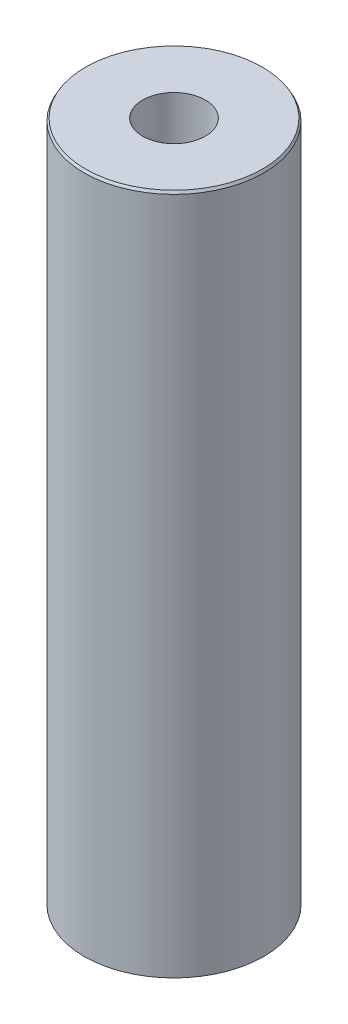
ISO-10303-21;
HEADER;
FILE_DESCRIPTION(('STEP AP214'),'2;1');
FILE_NAME('part.step','',(''),(''),'','','');
FILE_SCHEMA(('AUTOMOTIVE_DESIGN { 1 0 10303 214 1 1 1 1 }'));
ENDSEC;
DATA;
#1=APPLICATION_CONTEXT('core data for automotive mechanical design processes');
#2=APPLICATION_PROTOCOL_DEFINITION('international standard','automotive_design',2000,#1);
#3=PRODUCT_CONTEXT('',#1,'mechanical');
#4=PRODUCT('Part','Part','',(#3));
#5=PRODUCT_RELATED_PRODUCT_CATEGORY('part','',(#4));
#6=PRODUCT_DEFINITION_FORMATION('','',#4);
#7=PRODUCT_DEFINITION_CONTEXT('part definition',#1,'design');
#8=PRODUCT_DEFINITION('design','',#6,#7);
#9=PRODUCT_DEFINITION_SHAPE('','',#8);
#10=(LENGTH_UNIT() NAMED_UNIT(*) SI_UNIT(.MILLI.,.METRE.));
#11=(NAMED_UNIT(*) PLANE_ANGLE_UNIT() SI_UNIT($,.RADIAN.));
#12=(NAMED_UNIT(*) SI_UNIT($,.STERADIAN.) SOLID_ANGLE_UNIT());
#13=UNCERTAINTY_MEASURE_WITH_UNIT(LENGTH_MEASURE(1.E-05),#10,'distance_accuracy_value','');
#14=(GEOMETRIC_REPRESENTATION_CONTEXT(3) GLOBAL_UNCERTAINTY_ASSIGNED_CONTEXT((#13)) GLOBAL_UNIT_ASSIGNED_CONTEXT((#10,
#11,#12)) REPRESENTATION_CONTEXT('',''));
#15=CARTESIAN_POINT('',(0.,0.,0.));
#16=DIRECTION('',(0.,0.,1.));
#17=DIRECTION('',(1.,0.,0.));
#18=AXIS2_PLACEMENT_3D('',#15,#16,#17);
#19=CARTESIAN_POINT('',(0.,284.885670159614,0.));
#20=DIRECTION('',(0.,-1.,0.));
#21=DIRECTION('',(0.,0.,-1.));
#22=AXIS2_PLACEMENT_3D('',#19,#20,#21);
#23=CYLINDRICAL_SURFACE('',#22,37.5);
#24=CARTESIAN_POINT('',(0.,283.821531633377,0.));
#25=DIRECTION('',(0.,1.,0.));
#26=DIRECTION('',(0.,0.,1.));
#27=AXIS2_PLACEMENT_3D('',#24,#25,#26);
#28=CIRCLE('',#27,37.5);
#29=CARTESIAN_POINT('',(0.,283.821531633377,37.5));
#30=VERTEX_POINT('',#29);
#31=EDGE_CURVE('E50',#30,#30,#28,.F.);
#32=ORIENTED_EDGE('',*,*,#31,.T.);
#33=EDGE_LOOP('',(#32));
#34=FACE_BOUND('',#33,.T.);
#35=CARTESIAN_POINT('',(0.,0.614380664577918,0.));
#36=DIRECTION('',(0.,1.,0.));
#37=DIRECTION('',(0.,0.,1.));
#38=AXIS2_PLACEMENT_3D('',#35,#36,#37);
#39=CIRCLE('',#38,37.5);
#40=CARTESIAN_POINT('',(0.,0.614380664577918,37.5));
#41=VERTEX_POINT('',#40);
#42=EDGE_CURVE('E51',#41,#41,#39,.T.);
#43=ORIENTED_EDGE('',*,*,#42,.T.);
#44=EDGE_LOOP('',(#43));
#45=FACE_BOUND('',#44,.T.);
#46=ADVANCED_FACE('F39',(#34,#45),#23,.T.);
#47=CARTESIAN_POINT('',(0.,284.885670159614,0.));
#48=DIRECTION('',(0.,1.,0.));
#49=DIRECTION('',(0.,0.,1.));
#50=AXIS2_PLACEMENT_3D('',#47,#48,#49);
#51=PLANE('',#50);
#52=CARTESIAN_POINT('',(0.,284.885670159614,0.));
#53=DIRECTION('',(0.,1.,0.));
#54=DIRECTION('',(0.,0.,1.));
#55=AXIS2_PLACEMENT_3D('',#52,#53,#54);
#56=CIRCLE('',#55,36.885619335422);
#57=CARTESIAN_POINT('',(0.,284.885670159614,36.885619335422));
#58=VERTEX_POINT('',#57);
#59=EDGE_CURVE('E54',#58,#58,#56,.T.);
#60=ORIENTED_EDGE('',*,*,#59,.T.);
#61=EDGE_LOOP('',(#60));
#62=FACE_BOUND('',#61,.T.);
#63=CARTESIAN_POINT('',(0.,284.885670159614,0.));
#64=DIRECTION('',(0.,1.,0.));
#65=DIRECTION('',(0.,0.,1.));
#66=AXIS2_PLACEMENT_3D('',#63,#64,#65);
#67=CIRCLE('',#66,13.0947352424203);
#68=CARTESIAN_POINT('',(0.,284.885670159614,13.0947352424203));
#69=VERTEX_POINT('',#68);
#70=EDGE_CURVE('E58',#69,#69,#67,.T.);
#71=ORIENTED_EDGE('',*,*,#70,.F.);
#72=EDGE_LOOP('',(#71));
#73=FACE_BOUND('',#72,.T.);
#74=ADVANCED_FACE('F69',(#62,#73),#51,.T.);
#75=CARTESIAN_POINT('',(0.,0.,0.));
#76=DIRECTION('',(0.,1.,0.));
#77=DIRECTION('',(0.,0.,1.));
#78=AXIS2_PLACEMENT_3D('',#75,#76,#77);
#79=PLANE('',#78);
#80=CARTESIAN_POINT('',(0.,0.,0.));
#81=DIRECTION('',(0.,1.,0.));
#82=DIRECTION('',(0.,0.,1.));
#83=AXIS2_PLACEMENT_3D('',#80,#81,#82);
#84=CIRCLE('',#83,36.4358614737631);
#85=CARTESIAN_POINT('',(0.,0.,36.4358614737631));
#86=VERTEX_POINT('',#85);
#87=EDGE_CURVE('E10',#86,#86,#84,.F.);
#88=ORIENTED_EDGE('',*,*,#87,.T.);
#89=EDGE_LOOP('',(#88));
#90=FACE_BOUND('',#89,.T.);
#91=CARTESIAN_POINT('',(0.,0.,0.));
#92=DIRECTION('',(0.,1.,0.));
#93=DIRECTION('',(0.,0.,1.));
#94=AXIS2_PLACEMENT_3D('',#91,#92,#93);
#95=CIRCLE('',#94,13.0947352424203);
#96=CARTESIAN_POINT('',(0.,0.,13.0947352424203));
#97=VERTEX_POINT('',#96);
#98=EDGE_CURVE('E63',#97,#97,#95,.T.);
#99=ORIENTED_EDGE('',*,*,#98,.T.);
#100=EDGE_LOOP('',(#99));
#101=FACE_BOUND('',#100,.T.);
#102=ADVANCED_FACE('F75',(#90,#101),#79,.F.);
#103=CARTESIAN_POINT('',(0.,284.885670159614,0.));
#104=DIRECTION('',(0.,-1.,0.));
#105=DIRECTION('',(0.,0.,-1.));
#106=AXIS2_PLACEMENT_3D('',#103,#104,#105);
#107=CYLINDRICAL_SURFACE('',#106,13.0947352424203);
#108=ORIENTED_EDGE('',*,*,#70,.T.);
#109=EDGE_LOOP('',(#108));
#110=FACE_BOUND('',#109,.T.);
#111=ORIENTED_EDGE('',*,*,#98,.F.);
#112=EDGE_LOOP('',(#111));
#113=FACE_BOUND('',#112,.T.);
#114=ADVANCED_FACE('F70',(#110,#113),#107,.F.);
#115=CARTESIAN_POINT('',(0.,284.885670159614,0.));
#116=DIRECTION('',(0.,-1.,0.));
#117=DIRECTION('',(0.,0.,-1.));
#118=AXIS2_PLACEMENT_3D('',#115,#116,#117);
#119=CONICAL_SURFACE('',#118,36.885619335422,0.52359877559827);
#120=ORIENTED_EDGE('',*,*,#31,.F.);
#121=EDGE_LOOP('',(#120));
#122=FACE_BOUND('',#121,.T.);
#123=ORIENTED_EDGE('',*,*,#59,.F.);
#124=EDGE_LOOP('',(#123));
#125=FACE_BOUND('',#124,.T.);
#126=ADVANCED_FACE('F81',(#122,#125),#119,.T.);
#127=CARTESIAN_POINT('',(0.,0.614380664577918,0.));
#128=DIRECTION('',(0.,1.,0.));
#129=DIRECTION('',(0.,0.,1.));
#130=AXIS2_PLACEMENT_3D('',#127,#128,#129);
#131=CONICAL_SURFACE('',#130,37.5,1.04719755119662);
#132=ORIENTED_EDGE('',*,*,#87,.F.);
#133=EDGE_LOOP('',(#132));
#134=FACE_BOUND('',#133,.T.);
#135=ORIENTED_EDGE('',*,*,#42,.F.);
#136=EDGE_LOOP('',(#135));
#137=FACE_BOUND('',#136,.T.);
#138=ADVANCED_FACE('F45',(#134,#137),#131,.T.);
#139=CLOSED_SHELL('',(#46,#74,#102,#114,#126,#138));
#140=MANIFOLD_SOLID_BREP('B2',#139);
#141=ADVANCED_BREP_SHAPE_REPRESENTATION('',(#18,#140),#14);
#142=SHAPE_DEFINITION_REPRESENTATION(#9,#141);
ENDSEC;
END-ISO-10303-21;
